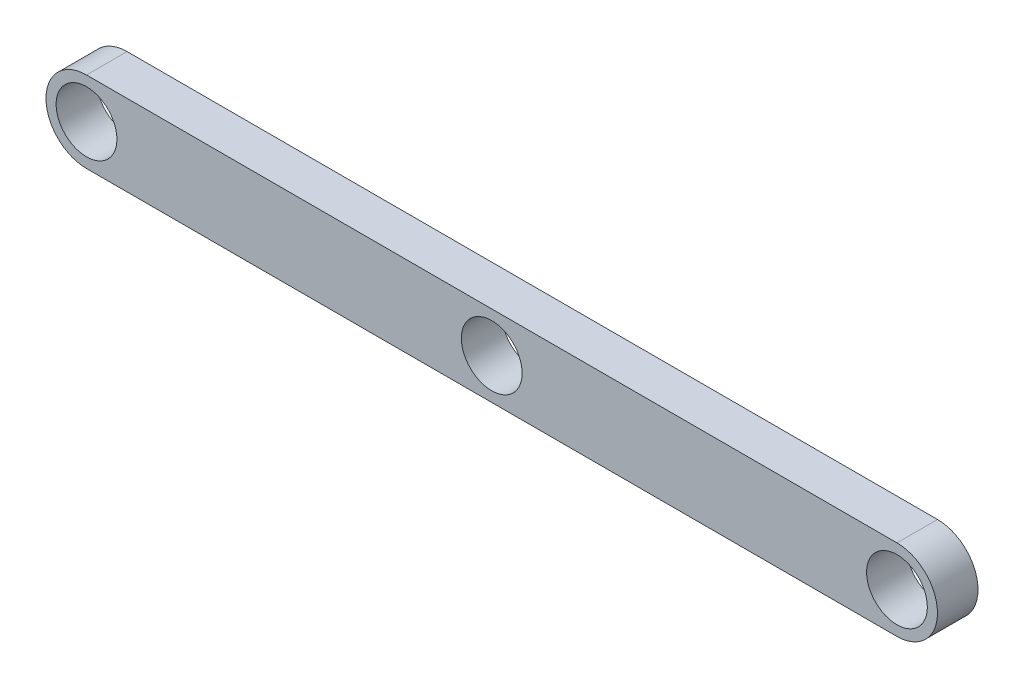
ISO-10303-21;
HEADER;
FILE_DESCRIPTION(('STEP AP214'),'2;1');
FILE_NAME('part.step','',(''),(''),'','','');
FILE_SCHEMA(('AUTOMOTIVE_DESIGN { 1 0 10303 214 1 1 1 1 }'));
ENDSEC;
DATA;
#1=APPLICATION_CONTEXT('core data for automotive mechanical design processes');
#2=APPLICATION_PROTOCOL_DEFINITION('international standard','automotive_design',2000,#1);
#3=PRODUCT_CONTEXT('',#1,'mechanical');
#4=PRODUCT('Part','Part','',(#3));
#5=PRODUCT_RELATED_PRODUCT_CATEGORY('part','',(#4));
#6=PRODUCT_DEFINITION_FORMATION('','',#4);
#7=PRODUCT_DEFINITION_CONTEXT('part definition',#1,'design');
#8=PRODUCT_DEFINITION('design','',#6,#7);
#9=PRODUCT_DEFINITION_SHAPE('','',#8);
#10=(LENGTH_UNIT() NAMED_UNIT(*) SI_UNIT(.MILLI.,.METRE.));
#11=(NAMED_UNIT(*) PLANE_ANGLE_UNIT() SI_UNIT($,.RADIAN.));
#12=(NAMED_UNIT(*) SI_UNIT($,.STERADIAN.) SOLID_ANGLE_UNIT());
#13=UNCERTAINTY_MEASURE_WITH_UNIT(LENGTH_MEASURE(1.E-05),#10,'distance_accuracy_value','');
#14=(GEOMETRIC_REPRESENTATION_CONTEXT(3) GLOBAL_UNCERTAINTY_ASSIGNED_CONTEXT((#13)) GLOBAL_UNIT_ASSIGNED_CONTEXT((#10,
#11,#12)) REPRESENTATION_CONTEXT('',''));
#15=CARTESIAN_POINT('',(0.,0.,0.));
#16=DIRECTION('',(0.,0.,1.));
#17=DIRECTION('',(1.,0.,0.));
#18=AXIS2_PLACEMENT_3D('',#15,#16,#17);
#19=CARTESIAN_POINT('',(63.5,0.,6.35));
#20=DIRECTION('',(0.,0.,-1.));
#21=DIRECTION('',(-1.,0.,0.));
#22=AXIS2_PLACEMENT_3D('',#19,#20,#21);
#23=CYLINDRICAL_SURFACE('',#22,6.35);
#24=CARTESIAN_POINT('',(63.5,0.,0.));
#25=DIRECTION('',(0.,0.,1.));
#26=DIRECTION('',(1.,0.,0.));
#27=AXIS2_PLACEMENT_3D('',#24,#25,#26);
#28=CIRCLE('',#27,6.35);
#29=CARTESIAN_POINT('',(63.5,-6.35,0.));
#30=VERTEX_POINT('',#29);
#31=CARTESIAN_POINT('',(63.5,6.35,0.));
#32=VERTEX_POINT('',#31);
#33=EDGE_CURVE('E115',#30,#32,#28,.T.);
#34=ORIENTED_EDGE('',*,*,#33,.T.);
#35=DIRECTION('',(0.,0.,-1.));
#36=VECTOR('',#35,1.);
#37=CARTESIAN_POINT('',(63.5,6.35,6.35));
#38=LINE('',#37,#36);
#39=CARTESIAN_POINT('',(63.5,6.35,6.35));
#40=VERTEX_POINT('',#39);
#41=EDGE_CURVE('E11',#40,#32,#38,.T.);
#42=ORIENTED_EDGE('',*,*,#41,.F.);
#43=CARTESIAN_POINT('',(63.5,0.,6.35));
#44=DIRECTION('',(0.,0.,1.));
#45=DIRECTION('',(1.,0.,0.));
#46=AXIS2_PLACEMENT_3D('',#43,#44,#45);
#47=CIRCLE('',#46,6.35);
#48=CARTESIAN_POINT('',(63.5,-6.35,6.35));
#49=VERTEX_POINT('',#48);
#50=EDGE_CURVE('E99',#49,#40,#47,.T.);
#51=ORIENTED_EDGE('',*,*,#50,.F.);
#52=DIRECTION('',(0.,0.,-1.));
#53=VECTOR('',#52,1.);
#54=CARTESIAN_POINT('',(63.5,-6.35,6.35));
#55=LINE('',#54,#53);
#56=EDGE_CURVE('E111',#49,#30,#55,.T.);
#57=ORIENTED_EDGE('',*,*,#56,.T.);
#58=EDGE_LOOP('',(#34,#42,#51,#57));
#59=FACE_BOUND('',#58,.T.);
#60=ADVANCED_FACE('F47',(#59),#23,.T.);
#61=CARTESIAN_POINT('',(-63.5,6.35,6.35));
#62=DIRECTION('',(0.,-1.,0.));
#63=DIRECTION('',(0.,0.,-1.));
#64=AXIS2_PLACEMENT_3D('',#61,#62,#63);
#65=PLANE('',#64);
#66=DIRECTION('',(-1.,0.,0.));
#67=VECTOR('',#66,1.);
#68=CARTESIAN_POINT('',(-63.5,6.35,0.));
#69=LINE('',#68,#67);
#70=CARTESIAN_POINT('',(-63.5,6.35,0.));
#71=VERTEX_POINT('',#70);
#72=EDGE_CURVE('E104',#32,#71,#69,.T.);
#73=ORIENTED_EDGE('',*,*,#72,.T.);
#74=DIRECTION('',(0.,0.,-1.));
#75=VECTOR('',#74,1.);
#76=CARTESIAN_POINT('',(-63.5,6.35,6.35));
#77=LINE('',#76,#75);
#78=CARTESIAN_POINT('',(-63.5,6.35,6.35));
#79=VERTEX_POINT('',#78);
#80=EDGE_CURVE('E56',#79,#71,#77,.T.);
#81=ORIENTED_EDGE('',*,*,#80,.F.);
#82=DIRECTION('',(-1.,0.,0.));
#83=VECTOR('',#82,1.);
#84=CARTESIAN_POINT('',(-63.5,6.35,6.35));
#85=LINE('',#84,#83);
#86=EDGE_CURVE('E94',#40,#79,#85,.T.);
#87=ORIENTED_EDGE('',*,*,#86,.F.);
#88=ORIENTED_EDGE('',*,*,#41,.T.);
#89=EDGE_LOOP('',(#73,#81,#87,#88));
#90=FACE_BOUND('',#89,.T.);
#91=ADVANCED_FACE('F103',(#90),#65,.F.);
#92=CARTESIAN_POINT('',(-63.5,0.,6.35));
#93=DIRECTION('',(0.,0.,-1.));
#94=DIRECTION('',(-1.,0.,0.));
#95=AXIS2_PLACEMENT_3D('',#92,#93,#94);
#96=CYLINDRICAL_SURFACE('',#95,6.35);
#97=CARTESIAN_POINT('',(-63.5,0.,0.));
#98=DIRECTION('',(0.,0.,1.));
#99=DIRECTION('',(1.,0.,0.));
#100=AXIS2_PLACEMENT_3D('',#97,#98,#99);
#101=CIRCLE('',#100,6.35);
#102=CARTESIAN_POINT('',(-63.5,-6.35,0.));
#103=VERTEX_POINT('',#102);
#104=EDGE_CURVE('E81',#71,#103,#101,.T.);
#105=ORIENTED_EDGE('',*,*,#104,.T.);
#106=DIRECTION('',(0.,0.,-1.));
#107=VECTOR('',#106,1.);
#108=CARTESIAN_POINT('',(-63.5,-6.35,6.35));
#109=LINE('',#108,#107);
#110=CARTESIAN_POINT('',(-63.5,-6.35,6.35));
#111=VERTEX_POINT('',#110);
#112=EDGE_CURVE('E106',#111,#103,#109,.T.);
#113=ORIENTED_EDGE('',*,*,#112,.F.);
#114=CARTESIAN_POINT('',(-63.5,0.,6.35));
#115=DIRECTION('',(0.,0.,1.));
#116=DIRECTION('',(1.,0.,0.));
#117=AXIS2_PLACEMENT_3D('',#114,#115,#116);
#118=CIRCLE('',#117,6.35);
#119=EDGE_CURVE('E97',#79,#111,#118,.T.);
#120=ORIENTED_EDGE('',*,*,#119,.F.);
#121=ORIENTED_EDGE('',*,*,#80,.T.);
#122=EDGE_LOOP('',(#105,#113,#120,#121));
#123=FACE_BOUND('',#122,.T.);
#124=ADVANCED_FACE('F107',(#123),#96,.T.);
#125=CARTESIAN_POINT('',(-63.5,-6.35,6.35));
#126=DIRECTION('',(0.,1.,0.));
#127=DIRECTION('',(0.,0.,1.));
#128=AXIS2_PLACEMENT_3D('',#125,#126,#127);
#129=PLANE('',#128);
#130=DIRECTION('',(1.,0.,0.));
#131=VECTOR('',#130,1.);
#132=CARTESIAN_POINT('',(-63.5,-6.35,0.));
#133=LINE('',#132,#131);
#134=EDGE_CURVE('E87',#103,#30,#133,.T.);
#135=ORIENTED_EDGE('',*,*,#134,.T.);
#136=ORIENTED_EDGE('',*,*,#56,.F.);
#137=DIRECTION('',(1.,0.,0.));
#138=VECTOR('',#137,1.);
#139=CARTESIAN_POINT('',(-63.5,-6.35,6.35));
#140=LINE('',#139,#138);
#141=EDGE_CURVE('E64',#111,#49,#140,.T.);
#142=ORIENTED_EDGE('',*,*,#141,.F.);
#143=ORIENTED_EDGE('',*,*,#112,.T.);
#144=EDGE_LOOP('',(#135,#136,#142,#143));
#145=FACE_BOUND('',#144,.T.);
#146=ADVANCED_FACE('F129',(#145),#129,.F.);
#147=CARTESIAN_POINT('',(63.5,0.,6.35));
#148=DIRECTION('',(0.,0.,1.));
#149=DIRECTION('',(1.,0.,0.));
#150=AXIS2_PLACEMENT_3D('',#147,#148,#149);
#151=PLANE('',#150);
#152=CARTESIAN_POINT('',(-63.5,0.,6.35));
#153=DIRECTION('',(0.,0.,1.));
#154=DIRECTION('',(1.,0.,0.));
#155=AXIS2_PLACEMENT_3D('',#152,#153,#154);
#156=CIRCLE('',#155,4.7625);
#157=CARTESIAN_POINT('',(-58.7375,0.,6.35));
#158=VERTEX_POINT('',#157);
#159=EDGE_CURVE('E155',#158,#158,#156,.T.);
#160=ORIENTED_EDGE('',*,*,#159,.F.);
#161=EDGE_LOOP('',(#160));
#162=FACE_BOUND('',#161,.T.);
#163=CARTESIAN_POINT('',(63.5,0.,6.35));
#164=DIRECTION('',(0.,0.,1.));
#165=DIRECTION('',(1.,0.,0.));
#166=AXIS2_PLACEMENT_3D('',#163,#164,#165);
#167=CIRCLE('',#166,4.7625);
#168=CARTESIAN_POINT('',(68.2625,0.,6.35));
#169=VERTEX_POINT('',#168);
#170=EDGE_CURVE('E147',#169,#169,#167,.T.);
#171=ORIENTED_EDGE('',*,*,#170,.F.);
#172=EDGE_LOOP('',(#171));
#173=FACE_BOUND('',#172,.T.);
#174=CARTESIAN_POINT('',(0.,0.,6.35));
#175=DIRECTION('',(0.,0.,1.));
#176=DIRECTION('',(1.,0.,0.));
#177=AXIS2_PLACEMENT_3D('',#174,#175,#176);
#178=CIRCLE('',#177,4.7625);
#179=CARTESIAN_POINT('',(4.7625,0.,6.35));
#180=VERTEX_POINT('',#179);
#181=EDGE_CURVE('E139',#180,#180,#178,.T.);
#182=ORIENTED_EDGE('',*,*,#181,.F.);
#183=EDGE_LOOP('',(#182));
#184=FACE_BOUND('',#183,.T.);
#185=ORIENTED_EDGE('',*,*,#50,.T.);
#186=ORIENTED_EDGE('',*,*,#86,.T.);
#187=ORIENTED_EDGE('',*,*,#119,.T.);
#188=ORIENTED_EDGE('',*,*,#141,.T.);
#189=EDGE_LOOP('',(#185,#186,#187,#188));
#190=FACE_BOUND('',#189,.T.);
#191=ADVANCED_FACE('F95',(#162,#173,#184,#190),#151,.T.);
#192=CARTESIAN_POINT('',(63.5,0.,0.));
#193=DIRECTION('',(0.,0.,1.));
#194=DIRECTION('',(1.,0.,0.));
#195=AXIS2_PLACEMENT_3D('',#192,#193,#194);
#196=PLANE('',#195);
#197=CARTESIAN_POINT('',(-63.5,0.,0.));
#198=DIRECTION('',(0.,0.,1.));
#199=DIRECTION('',(1.,0.,0.));
#200=AXIS2_PLACEMENT_3D('',#197,#198,#199);
#201=CIRCLE('',#200,4.7625);
#202=CARTESIAN_POINT('',(-58.7375,0.,0.));
#203=VERTEX_POINT('',#202);
#204=EDGE_CURVE('E151',#203,#203,#201,.T.);
#205=ORIENTED_EDGE('',*,*,#204,.T.);
#206=EDGE_LOOP('',(#205));
#207=FACE_BOUND('',#206,.T.);
#208=CARTESIAN_POINT('',(63.5,0.,0.));
#209=DIRECTION('',(0.,0.,1.));
#210=DIRECTION('',(1.,0.,0.));
#211=AXIS2_PLACEMENT_3D('',#208,#209,#210);
#212=CIRCLE('',#211,4.7625);
#213=CARTESIAN_POINT('',(68.2625,0.,0.));
#214=VERTEX_POINT('',#213);
#215=EDGE_CURVE('E143',#214,#214,#212,.T.);
#216=ORIENTED_EDGE('',*,*,#215,.T.);
#217=EDGE_LOOP('',(#216));
#218=FACE_BOUND('',#217,.T.);
#219=CARTESIAN_POINT('',(0.,0.,0.));
#220=DIRECTION('',(0.,0.,1.));
#221=DIRECTION('',(1.,0.,0.));
#222=AXIS2_PLACEMENT_3D('',#219,#220,#221);
#223=CIRCLE('',#222,4.7625);
#224=CARTESIAN_POINT('',(4.7625,0.,0.));
#225=VERTEX_POINT('',#224);
#226=EDGE_CURVE('E119',#225,#225,#223,.T.);
#227=ORIENTED_EDGE('',*,*,#226,.T.);
#228=EDGE_LOOP('',(#227));
#229=FACE_BOUND('',#228,.T.);
#230=ORIENTED_EDGE('',*,*,#33,.F.);
#231=ORIENTED_EDGE('',*,*,#134,.F.);
#232=ORIENTED_EDGE('',*,*,#104,.F.);
#233=ORIENTED_EDGE('',*,*,#72,.F.);
#234=EDGE_LOOP('',(#230,#231,#232,#233));
#235=FACE_BOUND('',#234,.T.);
#236=ADVANCED_FACE('F132',(#207,#218,#229,#235),#196,.F.);
#237=CARTESIAN_POINT('',(0.,0.,6.35));
#238=DIRECTION('',(0.,0.,1.));
#239=DIRECTION('',(1.,0.,0.));
#240=AXIS2_PLACEMENT_3D('',#237,#238,#239);
#241=CYLINDRICAL_SURFACE('',#240,4.7625);
#242=ORIENTED_EDGE('',*,*,#226,.F.);
#243=EDGE_LOOP('',(#242));
#244=FACE_BOUND('',#243,.T.);
#245=ORIENTED_EDGE('',*,*,#181,.T.);
#246=EDGE_LOOP('',(#245));
#247=FACE_BOUND('',#246,.T.);
#248=ADVANCED_FACE('F169',(#244,#247),#241,.F.);
#249=CARTESIAN_POINT('',(63.5,0.,6.35));
#250=DIRECTION('',(0.,0.,1.));
#251=DIRECTION('',(1.,0.,0.));
#252=AXIS2_PLACEMENT_3D('',#249,#250,#251);
#253=CYLINDRICAL_SURFACE('',#252,4.7625);
#254=ORIENTED_EDGE('',*,*,#215,.F.);
#255=EDGE_LOOP('',(#254));
#256=FACE_BOUND('',#255,.T.);
#257=ORIENTED_EDGE('',*,*,#170,.T.);
#258=EDGE_LOOP('',(#257));
#259=FACE_BOUND('',#258,.T.);
#260=ADVANCED_FACE('F171',(#256,#259),#253,.F.);
#261=CARTESIAN_POINT('',(-63.5,0.,6.35));
#262=DIRECTION('',(0.,0.,1.));
#263=DIRECTION('',(1.,0.,0.));
#264=AXIS2_PLACEMENT_3D('',#261,#262,#263);
#265=CYLINDRICAL_SURFACE('',#264,4.7625);
#266=ORIENTED_EDGE('',*,*,#204,.F.);
#267=EDGE_LOOP('',(#266));
#268=FACE_BOUND('',#267,.T.);
#269=ORIENTED_EDGE('',*,*,#159,.T.);
#270=EDGE_LOOP('',(#269));
#271=FACE_BOUND('',#270,.T.);
#272=ADVANCED_FACE('F160',(#268,#271),#265,.F.);
#273=CLOSED_SHELL('',(#60,#91,#124,#146,#191,#236,#248,#260,#272));
#274=MANIFOLD_SOLID_BREP('B2',#273);
#275=ADVANCED_BREP_SHAPE_REPRESENTATION('',(#18,#274),#14);
#276=SHAPE_DEFINITION_REPRESENTATION(#9,#275);
ENDSEC;
END-ISO-10303-21;
